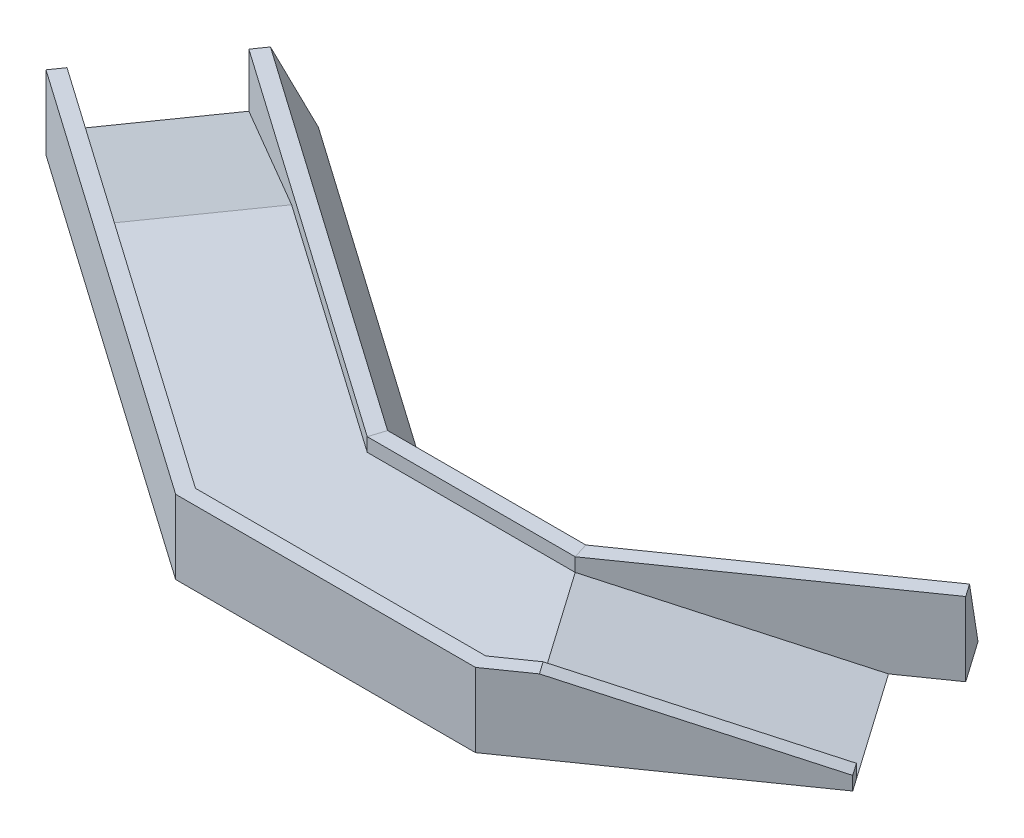
ISO-10303-21;
HEADER;
FILE_DESCRIPTION(('STEP AP214'),'2;1');
FILE_NAME('part.step','',(''),(''),'','','');
FILE_SCHEMA(('AUTOMOTIVE_DESIGN { 1 0 10303 214 1 1 1 1 }'));
ENDSEC;
DATA;
#1=APPLICATION_CONTEXT('core data for automotive mechanical design processes');
#2=APPLICATION_PROTOCOL_DEFINITION('international standard','automotive_design',2000,#1);
#3=PRODUCT_CONTEXT('',#1,'mechanical');
#4=PRODUCT('Part','Part','',(#3));
#5=PRODUCT_RELATED_PRODUCT_CATEGORY('part','',(#4));
#6=PRODUCT_DEFINITION_FORMATION('','',#4);
#7=PRODUCT_DEFINITION_CONTEXT('part definition',#1,'design');
#8=PRODUCT_DEFINITION('design','',#6,#7);
#9=PRODUCT_DEFINITION_SHAPE('','',#8);
#10=(LENGTH_UNIT() NAMED_UNIT(*) SI_UNIT(.MILLI.,.METRE.));
#11=(NAMED_UNIT(*) PLANE_ANGLE_UNIT() SI_UNIT($,.RADIAN.));
#12=(NAMED_UNIT(*) SI_UNIT($,.STERADIAN.) SOLID_ANGLE_UNIT());
#13=UNCERTAINTY_MEASURE_WITH_UNIT(LENGTH_MEASURE(1.E-05),#10,'distance_accuracy_value','');
#14=(GEOMETRIC_REPRESENTATION_CONTEXT(3) GLOBAL_UNCERTAINTY_ASSIGNED_CONTEXT((#13)) GLOBAL_UNIT_ASSIGNED_CONTEXT((#10,
#11,#12)) REPRESENTATION_CONTEXT('',''));
#15=CARTESIAN_POINT('',(0.,0.,0.));
#16=DIRECTION('',(0.,0.,1.));
#17=DIRECTION('',(1.,0.,0.));
#18=AXIS2_PLACEMENT_3D('',#15,#16,#17);
#19=CARTESIAN_POINT('',(0.,600.,0.));
#20=DIRECTION('',(0.,1.,0.));
#21=DIRECTION('',(0.,0.,1.));
#22=AXIS2_PLACEMENT_3D('',#19,#20,#21);
#23=PLANE('',#22);
#24=DIRECTION('',(0.819152044288991,0.,0.573576436351047));
#25=VECTOR('',#24,1.);
#26=CARTESIAN_POINT('',(0.,600.,0.));
#27=LINE('',#26,#25);
#28=CARTESIAN_POINT('',(-2510.30882601573,600.,-1757.73716321059));
#29=VERTEX_POINT('',#28);
#30=CARTESIAN_POINT('',(-4.19618988082814E-12,600.,0.));
#31=VERTEX_POINT('',#30);
#32=EDGE_CURVE('E333',#29,#31,#27,.T.);
#33=ORIENTED_EDGE('',*,*,#32,.F.);
#34=DIRECTION('',(-0.573576436351047,0.,0.819152044288991));
#35=VECTOR('',#34,1.);
#36=CARTESIAN_POINT('',(-2510.30882601573,600.,-1757.73716321059));
#37=LINE('',#36,#35);
#38=CARTESIAN_POINT('',(-3255.95819327209,600.,-692.839505634897));
#39=VERTEX_POINT('',#38);
#40=EDGE_CURVE('E206',#29,#39,#37,.T.);
#41=ORIENTED_EDGE('',*,*,#40,.T.);
#42=DIRECTION('',(-0.819152044288991,0.,-0.573576436351047));
#43=VECTOR('',#42,1.);
#44=CARTESIAN_POINT('',(-745.649367256361,600.,1064.89765757569));
#45=LINE('',#44,#43);
#46=CARTESIAN_POINT('',(-409.888425542679,600.,1300.));
#47=VERTEX_POINT('',#46);
#48=EDGE_CURVE('E195',#47,#39,#45,.T.);
#49=ORIENTED_EDGE('',*,*,#48,.F.);
#50=DIRECTION('',(-1.,0.,0.));
#51=VECTOR('',#50,1.);
#52=CARTESIAN_POINT('',(0.,600.,1300.));
#53=LINE('',#52,#51);
#54=CARTESIAN_POINT('',(2480.11157445732,600.,1300.));
#55=VERTEX_POINT('',#54);
#56=EDGE_CURVE('E46',#55,#47,#53,.T.);
#57=ORIENTED_EDGE('',*,*,#56,.F.);
#58=DIRECTION('',(-0.819152044288991,0.,0.573576436351048));
#59=VECTOR('',#58,1.);
#60=CARTESIAN_POINT('',(1426.73193265973,600.,2037.58436578332));
#61=LINE('',#60,#59);
#62=CARTESIAN_POINT('',(2815.6837142878,599.99999999999,1065.02985807754));
#63=VERTEX_POINT('',#62);
#64=EDGE_CURVE('E327',#63,#55,#61,.T.);
#65=ORIENTED_EDGE('',*,*,#64,.F.);
#66=DIRECTION('',(-0.573576436351046,0.,-0.819152044288992));
#67=VECTOR('',#66,1.);
#68=CARTESIAN_POINT('',(4145.36121802137,599.999999999982,2964.00613464447));
#69=LINE('',#68,#67);
#70=CARTESIAN_POINT('',(2070.03434703144,599.999999999994,0.132200501845925));
#71=VERTEX_POINT('',#70);
#72=EDGE_CURVE('E218',#63,#71,#69,.T.);
#73=ORIENTED_EDGE('',*,*,#72,.T.);
#74=DIRECTION('',(-0.819152044288992,0.,0.573576436351046));
#75=VECTOR('',#74,1.);
#76=CARTESIAN_POINT('',(3904.30457607769,600.,-1284.23764098999));
#77=LINE('',#76,#75);
#78=CARTESIAN_POINT('',(2070.22314891464,599.999999999994,1.54360257909578E-12));
#79=VERTEX_POINT('',#78);
#80=EDGE_CURVE('E213',#79,#71,#77,.T.);
#81=ORIENTED_EDGE('',*,*,#80,.F.);
#82=DIRECTION('',(1.,0.,0.));
#83=VECTOR('',#82,1.);
#84=CARTESIAN_POINT('',(0.,600.,0.));
#85=LINE('',#84,#83);
#86=EDGE_CURVE('E329',#31,#79,#85,.T.);
#87=ORIENTED_EDGE('',*,*,#86,.F.);
#88=EDGE_LOOP('',(#33,#41,#49,#57,#65,#73,#81,#87));
#89=FACE_BOUND('',#88,.T.);
#90=ADVANCED_FACE('F38',(#89),#23,.T.);
#91=CARTESIAN_POINT('',(-3929.5637528991,600.,-2751.51016165559));
#92=DIRECTION('',(-0.819152044288991,0.,-0.573576436351047));
#93=DIRECTION('',(-0.573576436351047,0.,0.819152044288991));
#94=AXIS2_PLACEMENT_3D('',#91,#92,#93);
#95=PLANE('',#94);
#96=DIRECTION('',(0.,-1.,0.));
#97=VECTOR('',#96,1.);
#98=CARTESIAN_POINT('',(-4675.21312015546,735.,-1686.6125040799));
#99=LINE('',#98,#97);
#100=CARTESIAN_POINT('',(-4675.21312015546,735.,-1686.6125040799));
#101=VERTEX_POINT('',#100);
#102=CARTESIAN_POINT('',(-4675.21312015546,200.,-1686.6125040799));
#103=VERTEX_POINT('',#102);
#104=EDGE_CURVE('E178',#101,#103,#99,.T.);
#105=ORIENTED_EDGE('',*,*,#104,.T.);
#106=DIRECTION('',(-0.573576436351047,0.,0.819152044288991));
#107=VECTOR('',#106,1.);
#108=CARTESIAN_POINT('',(-2565.42970008092,200.,-4699.69549011691));
#109=LINE('',#108,#107);
#110=CARTESIAN_POINT('',(-3929.5637528991,200.,-2751.51016165559));
#111=VERTEX_POINT('',#110);
#112=EDGE_CURVE('E182',#111,#103,#109,.T.);
#113=ORIENTED_EDGE('',*,*,#112,.F.);
#114=DIRECTION('',(0.,1.,0.));
#115=VECTOR('',#114,1.);
#116=CARTESIAN_POINT('',(-3929.5637528991,0.,-2751.5101616556));
#117=LINE('',#116,#115);
#118=CARTESIAN_POINT('',(-3929.5637528991,735.,-2751.51016165559));
#119=VERTEX_POINT('',#118);
#120=EDGE_CURVE('E232',#111,#119,#117,.T.);
#121=ORIENTED_EDGE('',*,*,#120,.T.);
#122=DIRECTION('',(0.573576436351047,0.,-0.819152044288991));
#123=VECTOR('',#122,1.);
#124=CARTESIAN_POINT('',(-3929.5637528991,735.,-2751.51016165559));
#125=LINE('',#124,#123);
#126=CARTESIAN_POINT('',(-3841.08163136633,735.,-2877.87572715494));
#127=VERTEX_POINT('',#126);
#128=EDGE_CURVE('E228',#119,#127,#125,.T.);
#129=ORIENTED_EDGE('',*,*,#128,.T.);
#130=DIRECTION('',(0.242403876506107,-0.906307787036648,-0.346188613058758));
#131=VECTOR('',#130,1.);
#132=CARTESIAN_POINT('',(-3841.08163136633,735.,-2877.87572715494));
#133=LINE('',#132,#131);
#134=CARTESIAN_POINT('',(-3644.49626403263,0.,-3158.62872766722));
#135=VERTEX_POINT('',#134);
#136=EDGE_CURVE('E225',#127,#135,#133,.T.);
#137=ORIENTED_EDGE('',*,*,#136,.T.);
#138=DIRECTION('',(0.573576436351047,0.,-0.819152044288991));
#139=VECTOR('',#138,1.);
#140=CARTESIAN_POINT('',(-3929.5637528991,0.,-2751.51016165559));
#141=LINE('',#140,#139);
#142=CARTESIAN_POINT('',(-4761.24958560812,0.,-1563.73969743656));
#143=VERTEX_POINT('',#142);
#144=EDGE_CURVE('E330',#143,#135,#141,.T.);
#145=ORIENTED_EDGE('',*,*,#144,.F.);
#146=DIRECTION('',(0.,-1.,0.));
#147=VECTOR('',#146,1.);
#148=CARTESIAN_POINT('',(-4761.24958560812,735.,-1563.73969743656));
#149=LINE('',#148,#147);
#150=CARTESIAN_POINT('',(-4761.24958560812,735.,-1563.73969743656));
#151=VERTEX_POINT('',#150);
#152=EDGE_CURVE('E188',#151,#143,#149,.T.);
#153=ORIENTED_EDGE('',*,*,#152,.F.);
#154=DIRECTION('',(-0.573576436351048,0.,0.81915204428899));
#155=VECTOR('',#154,1.);
#156=CARTESIAN_POINT('',(-4761.24958560812,735.,-1563.73969743656));
#157=LINE('',#156,#155);
#158=EDGE_CURVE('E184',#101,#151,#157,.T.);
#159=ORIENTED_EDGE('',*,*,#158,.F.);
#160=EDGE_LOOP('',(#105,#113,#121,#129,#137,#145,#153,#159));
#161=FACE_BOUND('',#160,.T.);
#162=ADVANCED_FACE('F180',(#161),#95,.T.);
#163=CARTESIAN_POINT('',(3223.22201067432,600.,-2256.92434919762));
#164=DIRECTION('',(0.819152044288991,0.,-0.573576436351048));
#165=DIRECTION('',(-0.573576436351048,0.,-0.819152044288991));
#166=AXIS2_PLACEMENT_3D('',#163,#164,#165);
#167=PLANE('',#166);
#168=DIRECTION('',(0.,-1.,0.));
#169=VECTOR('',#168,1.);
#170=CARTESIAN_POINT('',(4649.95394333405,735.,-219.339983414307));
#171=LINE('',#170,#169);
#172=CARTESIAN_POINT('',(4649.95394333405,135.000000000004,-219.339983414305));
#173=VERTEX_POINT('',#172);
#174=CARTESIAN_POINT('',(4649.95394333407,-1.26088293488827E-11,-219.339983414322));
#175=VERTEX_POINT('',#174);
#176=EDGE_CURVE('E312',#173,#175,#171,.T.);
#177=ORIENTED_EDGE('',*,*,#176,.F.);
#178=DIRECTION('',(-0.573576436351047,0.,-0.819152044288991));
#179=VECTOR('',#178,1.);
#180=CARTESIAN_POINT('',(5462.59230593635,135.000000000004,941.227874338341));
#181=LINE('',#180,#179);
#182=CARTESIAN_POINT('',(4735.99040878671,135.000000000004,-96.4671767709577));
#183=VERTEX_POINT('',#182);
#184=EDGE_CURVE('E209',#183,#173,#181,.T.);
#185=ORIENTED_EDGE('',*,*,#184,.F.);
#186=DIRECTION('',(0.,-1.,0.));
#187=VECTOR('',#186,1.);
#188=CARTESIAN_POINT('',(4735.99040878671,735.,-96.4671767709581));
#189=LINE('',#188,#187);
#190=CARTESIAN_POINT('',(4735.99040878671,0.,-96.4671767709579));
#191=VERTEX_POINT('',#190);
#192=EDGE_CURVE('E314',#183,#191,#189,.T.);
#193=ORIENTED_EDGE('',*,*,#192,.T.);
#194=DIRECTION('',(0.573576436351048,0.,0.819152044288991));
#195=VECTOR('',#194,1.);
#196=CARTESIAN_POINT('',(3223.22201067432,0.,-2256.92434919762));
#197=LINE('',#196,#195);
#198=EDGE_CURVE('E326',#175,#191,#197,.T.);
#199=ORIENTED_EDGE('',*,*,#198,.F.);
#200=EDGE_LOOP('',(#177,#185,#193,#199));
#201=FACE_BOUND('',#200,.T.);
#202=ADVANCED_FACE('F40',(#201),#167,.T.);
#203=CARTESIAN_POINT('',(2480.11157445732,735.,1300.));
#204=DIRECTION('',(0.573576436351048,0.,0.819152044288991));
#205=DIRECTION('',(0.819152044288991,0.,-0.573576436351048));
#206=AXIS2_PLACEMENT_3D('',#203,#204,#205);
#207=PLANE('',#206);
#208=DIRECTION('',(0.791240115236223,-0.258819045102519,-0.554032293222325));
#209=VECTOR('',#208,1.);
#210=CARTESIAN_POINT('',(1670.29324785109,1109.6635958974,1867.04089687006));
#211=LINE('',#210,#209);
#212=CARTESIAN_POINT('',(2815.6837142878,735.,1065.02985807754));
#213=VERTEX_POINT('',#212);
#214=EDGE_CURVE('E52',#213,#173,#211,.T.);
#215=ORIENTED_EDGE('',*,*,#214,.T.);
#216=ORIENTED_EDGE('',*,*,#176,.T.);
#217=DIRECTION('',(0.791240115236223,-0.258819045102519,-0.554032293222325));
#218=VECTOR('',#217,1.);
#219=CARTESIAN_POINT('',(4649.95394333405,-3.69724275688654E-12,-219.339983414303));
#220=LINE('',#219,#218);
#221=EDGE_CURVE('E217',#63,#175,#220,.T.);
#222=ORIENTED_EDGE('',*,*,#221,.F.);
#223=ORIENTED_EDGE('',*,*,#64,.T.);
#224=DIRECTION('',(0.,-1.,0.));
#225=VECTOR('',#224,1.);
#226=CARTESIAN_POINT('',(2480.11157445732,735.,1300.));
#227=LINE('',#226,#225);
#228=CARTESIAN_POINT('',(2480.11157445732,735.,1300.));
#229=VERTEX_POINT('',#228);
#230=EDGE_CURVE('E323',#229,#55,#227,.T.);
#231=ORIENTED_EDGE('',*,*,#230,.F.);
#232=DIRECTION('',(-0.819152044288991,0.,0.573576436351048));
#233=VECTOR('',#232,1.);
#234=CARTESIAN_POINT('',(2480.11157445732,735.,1300.));
#235=LINE('',#234,#233);
#236=EDGE_CURVE('E298',#213,#229,#235,.T.);
#237=ORIENTED_EDGE('',*,*,#236,.F.);
#238=EDGE_LOOP('',(#215,#216,#222,#223,#231,#237));
#239=FACE_BOUND('',#238,.T.);
#240=ADVANCED_FACE('F427',(#239),#207,.F.);
#241=CARTESIAN_POINT('',(4735.99040878671,735.,-96.4671767709581));
#242=DIRECTION('',(-0.573576436351048,0.,-0.819152044288991));
#243=DIRECTION('',(-0.819152044288991,0.,0.573576436351048));
#244=AXIS2_PLACEMENT_3D('',#241,#242,#243);
#245=PLANE('',#244);
#246=DIRECTION('',(0.791240115236223,-0.258819045102519,-0.554032293222325));
#247=VECTOR('',#246,1.);
#248=CARTESIAN_POINT('',(4613.11760214336,175.192378864672,-10.4307113183021));
#249=LINE('',#248,#247);
#250=CARTESIAN_POINT('',(2901.72017974045,735.,1187.90266472089));
#251=VERTEX_POINT('',#250);
#252=EDGE_CURVE('E211',#251,#183,#249,.T.);
#253=ORIENTED_EDGE('',*,*,#252,.F.);
#254=DIRECTION('',(0.819152044288991,0.,-0.573576436351048));
#255=VECTOR('',#254,1.);
#256=CARTESIAN_POINT('',(4735.99040878671,735.,-96.4671767709581));
#257=LINE('',#256,#255);
#258=CARTESIAN_POINT('',(2527.40639278917,735.,1450.));
#259=VERTEX_POINT('',#258);
#260=EDGE_CURVE('E309',#259,#251,#257,.T.);
#261=ORIENTED_EDGE('',*,*,#260,.F.);
#262=DIRECTION('',(0.,-1.,0.));
#263=VECTOR('',#262,1.);
#264=CARTESIAN_POINT('',(2527.40639278917,735.,1450.));
#265=LINE('',#264,#263);
#266=CARTESIAN_POINT('',(2527.40639278917,0.,1450.));
#267=VERTEX_POINT('',#266);
#268=EDGE_CURVE('E316',#259,#267,#265,.T.);
#269=ORIENTED_EDGE('',*,*,#268,.T.);
#270=DIRECTION('',(-0.819152044288991,0.,0.573576436351048));
#271=VECTOR('',#270,1.);
#272=CARTESIAN_POINT('',(4735.99040878671,0.,-96.4671767709581));
#273=LINE('',#272,#271);
#274=EDGE_CURVE('E295',#191,#267,#273,.T.);
#275=ORIENTED_EDGE('',*,*,#274,.F.);
#276=ORIENTED_EDGE('',*,*,#192,.F.);
#277=EDGE_LOOP('',(#253,#261,#269,#275,#276));
#278=FACE_BOUND('',#277,.T.);
#279=ADVANCED_FACE('F379',(#278),#245,.F.);
#280=CARTESIAN_POINT('',(0.,735.,0.));
#281=DIRECTION('',(0.,-1.,0.));
#282=DIRECTION('',(0.,0.,-1.));
#283=AXIS2_PLACEMENT_3D('',#280,#281,#282);
#284=PLANE('',#283);
#285=DIRECTION('',(0.573576436351047,0.,0.819152044288991));
#286=VECTOR('',#285,1.);
#287=CARTESIAN_POINT('',(1388.95178162806,735.,-972.554507705779));
#288=LINE('',#287,#286);
#289=EDGE_CURVE('E11',#213,#251,#288,.T.);
#290=ORIENTED_EDGE('',*,*,#289,.F.);
#291=ORIENTED_EDGE('',*,*,#236,.T.);
#292=DIRECTION('',(-1.,0.,0.));
#293=VECTOR('',#292,1.);
#294=CARTESIAN_POINT('',(-409.888425542679,735.,1300.));
#295=LINE('',#294,#293);
#296=CARTESIAN_POINT('',(-409.888425542679,735.,1300.));
#297=VERTEX_POINT('',#296);
#298=EDGE_CURVE('E300',#229,#297,#295,.T.);
#299=ORIENTED_EDGE('',*,*,#298,.T.);
#300=DIRECTION('',(-0.819152044288991,0.,-0.573576436351047));
#301=VECTOR('',#300,1.);
#302=CARTESIAN_POINT('',(-4675.21312015546,735.,-1686.6125040799));
#303=LINE('',#302,#301);
#304=EDGE_CURVE('E302',#297,#101,#303,.T.);
#305=ORIENTED_EDGE('',*,*,#304,.T.);
#306=ORIENTED_EDGE('',*,*,#158,.T.);
#307=DIRECTION('',(0.819152044288991,0.,0.573576436351047));
#308=VECTOR('',#307,1.);
#309=CARTESIAN_POINT('',(-457.183243874526,735.,1450.));
#310=LINE('',#309,#308);
#311=CARTESIAN_POINT('',(-457.183243874526,735.,1450.));
#312=VERTEX_POINT('',#311);
#313=EDGE_CURVE('E305',#151,#312,#310,.T.);
#314=ORIENTED_EDGE('',*,*,#313,.T.);
#315=DIRECTION('',(1.,0.,0.));
#316=VECTOR('',#315,1.);
#317=CARTESIAN_POINT('',(2527.40639278917,735.,1450.));
#318=LINE('',#317,#316);
#319=EDGE_CURVE('E307',#312,#259,#318,.T.);
#320=ORIENTED_EDGE('',*,*,#319,.T.);
#321=ORIENTED_EDGE('',*,*,#260,.T.);
#322=EDGE_LOOP('',(#290,#291,#299,#305,#306,#314,#320,#321));
#323=FACE_BOUND('',#322,.T.);
#324=ADVANCED_FACE('F391',(#323),#284,.F.);
#325=CARTESIAN_POINT('',(0.,0.,0.));
#326=DIRECTION('',(0.,1.,0.));
#327=DIRECTION('',(0.,0.,1.));
#328=AXIS2_PLACEMENT_3D('',#325,#326,#327);
#329=PLANE('',#328);
#330=DIRECTION('',(0.819152044288992,0.,-0.573576436351046));
#331=VECTOR('',#330,1.);
#332=CARTESIAN_POINT('',(1785.15566004816,0.,-407.118566011627));
#333=LINE('',#332,#331);
#334=CARTESIAN_POINT('',(1913.51965084178,0.,-497.000000000001));
#335=VERTEX_POINT('',#334);
#336=CARTESIAN_POINT('',(4071.40901565874,0.,-2007.9703998674));
#337=VERTEX_POINT('',#336);
#338=EDGE_CURVE('E265',#335,#337,#333,.T.);
#339=ORIENTED_EDGE('',*,*,#338,.T.);
#340=DIRECTION('',(0.573576436351046,0.,0.819152044288992));
#341=VECTOR('',#340,1.);
#342=CARTESIAN_POINT('',(4071.40901565874,0.,-2007.9703998674));
#343=LINE('',#342,#341);
#344=CARTESIAN_POINT('',(4356.47650452521,0.,-1600.85183385577));
#345=VERTEX_POINT('',#344);
#346=EDGE_CURVE('E283',#337,#345,#343,.T.);
#347=ORIENTED_EDGE('',*,*,#346,.T.);
#348=DIRECTION('',(0.819152044288992,0.,-0.573576436351046));
#349=VECTOR('',#348,1.);
#350=CARTESIAN_POINT('',(2070.22314891463,0.,2.22044604925031E-12));
#351=LINE('',#350,#349);
#352=CARTESIAN_POINT('',(3904.30457607769,0.,-1284.23764098999));
#353=VERTEX_POINT('',#352);
#354=EDGE_CURVE('E281',#353,#345,#351,.T.);
#355=ORIENTED_EDGE('',*,*,#354,.F.);
#356=EDGE_CURVE('E337',#353,#175,#197,.T.);
#357=ORIENTED_EDGE('',*,*,#356,.T.);
#358=ORIENTED_EDGE('',*,*,#198,.T.);
#359=ORIENTED_EDGE('',*,*,#274,.T.);
#360=DIRECTION('',(-1.,0.,0.));
#361=VECTOR('',#360,1.);
#362=CARTESIAN_POINT('',(2527.40639278917,0.,1450.));
#363=LINE('',#362,#361);
#364=CARTESIAN_POINT('',(-457.183243874526,0.,1450.));
#365=VERTEX_POINT('',#364);
#366=EDGE_CURVE('E292',#267,#365,#363,.T.);
#367=ORIENTED_EDGE('',*,*,#366,.T.);
#368=DIRECTION('',(-0.819152044288991,0.,-0.573576436351047));
#369=VECTOR('',#368,1.);
#370=CARTESIAN_POINT('',(-457.183243874526,0.,1450.));
#371=LINE('',#370,#369);
#372=EDGE_CURVE('E240',#365,#143,#371,.T.);
#373=ORIENTED_EDGE('',*,*,#372,.T.);
#374=ORIENTED_EDGE('',*,*,#144,.T.);
#375=DIRECTION('',(0.819152044288991,0.,0.573576436351047));
#376=VECTOR('',#375,1.);
#377=CARTESIAN_POINT('',(-3644.49626403263,0.,-3158.62872766722));
#378=LINE('',#377,#376);
#379=CARTESIAN_POINT('',(156.703498072856,0.,-497.));
#380=VERTEX_POINT('',#379);
#381=EDGE_CURVE('E229',#135,#380,#378,.T.);
#382=ORIENTED_EDGE('',*,*,#381,.T.);
#383=DIRECTION('',(1.,0.,0.));
#384=VECTOR('',#383,1.);
#385=CARTESIAN_POINT('',(-4.44089209850063E-12,0.,-497.));
#386=LINE('',#385,#384);
#387=EDGE_CURVE('E255',#380,#335,#386,.T.);
#388=ORIENTED_EDGE('',*,*,#387,.T.);
#389=EDGE_LOOP('',(#339,#347,#355,#357,#358,#359,#367,#373,#374,#382,#388));
#390=FACE_BOUND('',#389,.T.);
#391=ADVANCED_FACE('F339',(#390),#329,.F.);
#392=CARTESIAN_POINT('',(-409.888425542679,735.,1300.));
#393=DIRECTION('',(0.,0.,1.));
#394=DIRECTION('',(1.,0.,0.));
#395=AXIS2_PLACEMENT_3D('',#392,#393,#394);
#396=PLANE('',#395);
#397=ORIENTED_EDGE('',*,*,#56,.T.);
#398=DIRECTION('',(0.,-1.,0.));
#399=VECTOR('',#398,1.);
#400=CARTESIAN_POINT('',(-409.888425542679,735.,1300.));
#401=LINE('',#400,#399);
#402=EDGE_CURVE('E187',#297,#47,#401,.T.);
#403=ORIENTED_EDGE('',*,*,#402,.F.);
#404=ORIENTED_EDGE('',*,*,#298,.F.);
#405=ORIENTED_EDGE('',*,*,#230,.T.);
#406=EDGE_LOOP('',(#397,#403,#404,#405));
#407=FACE_BOUND('',#406,.T.);
#408=ADVANCED_FACE('F430',(#407),#396,.F.);
#409=CARTESIAN_POINT('',(-4675.21312015546,735.,-1686.6125040799));
#410=DIRECTION('',(-0.573576436351047,0.,0.819152044288991));
#411=DIRECTION('',(0.819152044288991,0.,0.573576436351047));
#412=AXIS2_PLACEMENT_3D('',#409,#410,#411);
#413=PLANE('',#412);
#414=ORIENTED_EDGE('',*,*,#104,.F.);
#415=ORIENTED_EDGE('',*,*,#304,.F.);
#416=ORIENTED_EDGE('',*,*,#402,.T.);
#417=ORIENTED_EDGE('',*,*,#48,.T.);
#418=DIRECTION('',(-0.798157230462824,-0.224951054343859,-0.558875709446655));
#419=VECTOR('',#418,1.);
#420=CARTESIAN_POINT('',(-4675.21312015546,200.,-1686.6125040799));
#421=LINE('',#420,#419);
#422=EDGE_CURVE('E191',#39,#103,#421,.T.);
#423=ORIENTED_EDGE('',*,*,#422,.T.);
#424=EDGE_LOOP('',(#414,#415,#416,#417,#423));
#425=FACE_BOUND('',#424,.T.);
#426=ADVANCED_FACE('F192',(#425),#413,.F.);
#427=CARTESIAN_POINT('',(-457.183243874526,735.,1450.));
#428=DIRECTION('',(0.573576436351047,0.,-0.819152044288991));
#429=DIRECTION('',(-0.819152044288991,0.,-0.573576436351047));
#430=AXIS2_PLACEMENT_3D('',#427,#428,#429);
#431=PLANE('',#430);
#432=ORIENTED_EDGE('',*,*,#152,.T.);
#433=ORIENTED_EDGE('',*,*,#372,.F.);
#434=DIRECTION('',(0.,-1.,0.));
#435=VECTOR('',#434,1.);
#436=CARTESIAN_POINT('',(-457.183243874526,735.,1450.));
#437=LINE('',#436,#435);
#438=EDGE_CURVE('E318',#312,#365,#437,.T.);
#439=ORIENTED_EDGE('',*,*,#438,.F.);
#440=ORIENTED_EDGE('',*,*,#313,.F.);
#441=EDGE_LOOP('',(#432,#433,#439,#440));
#442=FACE_BOUND('',#441,.T.);
#443=ADVANCED_FACE('F389',(#442),#431,.F.);
#444=CARTESIAN_POINT('',(2527.40639278917,735.,1450.));
#445=DIRECTION('',(0.,0.,-1.));
#446=DIRECTION('',(-1.,0.,0.));
#447=AXIS2_PLACEMENT_3D('',#444,#445,#446);
#448=PLANE('',#447);
#449=ORIENTED_EDGE('',*,*,#438,.T.);
#450=ORIENTED_EDGE('',*,*,#366,.F.);
#451=ORIENTED_EDGE('',*,*,#268,.F.);
#452=ORIENTED_EDGE('',*,*,#319,.F.);
#453=EDGE_LOOP('',(#449,#450,#451,#452));
#454=FACE_BOUND('',#453,.T.);
#455=ADVANCED_FACE('F384',(#454),#448,.F.);
#456=CARTESIAN_POINT('',(2070.22314891463,0.,2.22044604925031E-12));
#457=DIRECTION('',(-0.573576436351046,0.,-0.819152044288992));
#458=DIRECTION('',(-0.819152044288992,0.,0.573576436351046));
#459=AXIS2_PLACEMENT_3D('',#456,#457,#458);
#460=PLANE('',#459);
#461=DIRECTION('',(0.791240115236224,-0.258819045102519,-0.554032293222324));
#462=VECTOR('',#461,1.);
#463=CARTESIAN_POINT('',(3904.30457607769,0.,-1284.23764098999));
#464=LINE('',#463,#462);
#465=EDGE_CURVE('E214',#71,#353,#464,.T.);
#466=ORIENTED_EDGE('',*,*,#465,.T.);
#467=ORIENTED_EDGE('',*,*,#354,.T.);
#468=DIRECTION('',(0.,1.,0.));
#469=VECTOR('',#468,1.);
#470=CARTESIAN_POINT('',(4356.47650452521,0.,-1600.85183385577));
#471=LINE('',#470,#469);
#472=CARTESIAN_POINT('',(4356.47650452521,735.,-1600.85183385576));
#473=VERTEX_POINT('',#472);
#474=EDGE_CURVE('E279',#345,#473,#471,.T.);
#475=ORIENTED_EDGE('',*,*,#474,.T.);
#476=DIRECTION('',(0.819152044288992,0.,-0.573576436351046));
#477=VECTOR('',#476,1.);
#478=CARTESIAN_POINT('',(2070.22314891463,735.,3.99680288865056E-12));
#479=LINE('',#478,#477);
#480=CARTESIAN_POINT('',(2070.22314891463,735.,3.37588030446812E-12));
#481=VERTEX_POINT('',#480);
#482=EDGE_CURVE('E276',#481,#473,#479,.T.);
#483=ORIENTED_EDGE('',*,*,#482,.F.);
#484=DIRECTION('',(0.,1.,0.));
#485=VECTOR('',#484,1.);
#486=CARTESIAN_POINT('',(2070.22314891463,0.,-3.53666748664772E-13));
#487=LINE('',#486,#485);
#488=EDGE_CURVE('E252',#79,#481,#487,.T.);
#489=ORIENTED_EDGE('',*,*,#488,.F.);
#490=ORIENTED_EDGE('',*,*,#80,.T.);
#491=EDGE_LOOP('',(#466,#467,#475,#483,#489,#490));
#492=FACE_BOUND('',#491,.T.);
#493=ADVANCED_FACE('F362',(#492),#460,.F.);
#494=CARTESIAN_POINT('',(4356.47650452521,1.18959085942724E-12,-1600.85183385577));
#495=DIRECTION('',(-0.819152044288992,0.,0.573576436351046));
#496=DIRECTION('',(0.573576436351046,0.,0.819152044288992));
#497=AXIS2_PLACEMENT_3D('',#494,#495,#496);
#498=PLANE('',#497);
#499=ORIENTED_EDGE('',*,*,#346,.F.);
#500=DIRECTION('',(-0.242403876506107,-0.906307787036648,-0.346188613058758));
#501=VECTOR('',#500,1.);
#502=CARTESIAN_POINT('',(4267.99438299244,735.,-1727.21739935511));
#503=LINE('',#502,#501);
#504=CARTESIAN_POINT('',(4267.99438299244,735.,-1727.21739935511));
#505=VERTEX_POINT('',#504);
#506=EDGE_CURVE('E222',#505,#337,#503,.T.);
#507=ORIENTED_EDGE('',*,*,#506,.F.);
#508=DIRECTION('',(-0.573576436351046,0.,-0.819152044288992));
#509=VECTOR('',#508,1.);
#510=CARTESIAN_POINT('',(4356.47650452521,735.,-1600.85183385576));
#511=LINE('',#510,#509);
#512=EDGE_CURVE('E274',#473,#505,#511,.T.);
#513=ORIENTED_EDGE('',*,*,#512,.F.);
#514=ORIENTED_EDGE('',*,*,#474,.F.);
#515=EDGE_LOOP('',(#499,#507,#513,#514));
#516=FACE_BOUND('',#515,.T.);
#517=ADVANCED_FACE('F359',(#516),#498,.F.);
#518=CARTESIAN_POINT('',(2070.22314891463,735.,3.99680288865056E-12));
#519=DIRECTION('',(0.,-1.,0.));
#520=DIRECTION('',(0.,0.,-1.));
#521=AXIS2_PLACEMENT_3D('',#518,#519,#520);
#522=PLANE('',#521);
#523=DIRECTION('',(0.300705799504273,0.,0.953716950748227));
#524=VECTOR('',#523,1.);
#525=CARTESIAN_POINT('',(1883.02533674123,735.,-593.715608102947));
#526=LINE('',#525,#524);
#527=CARTESIAN_POINT('',(2021.58393713981,735.,-154.263871256072));
#528=VERTEX_POINT('',#527);
#529=EDGE_CURVE('E262',#528,#481,#526,.T.);
#530=ORIENTED_EDGE('',*,*,#529,.T.);
#531=ORIENTED_EDGE('',*,*,#482,.T.);
#532=ORIENTED_EDGE('',*,*,#512,.T.);
#533=DIRECTION('',(0.819152044288992,0.,-0.573576436351046));
#534=VECTOR('',#533,1.);
#535=CARTESIAN_POINT('',(1981.74102738186,735.,-126.365565499344));
#536=LINE('',#535,#534);
#537=EDGE_CURVE('E273',#528,#505,#536,.T.);
#538=ORIENTED_EDGE('',*,*,#537,.F.);
#539=EDGE_LOOP('',(#530,#531,#532,#538));
#540=FACE_BOUND('',#539,.T.);
#541=ADVANCED_FACE('F409',(#540),#522,.F.);
#542=CARTESIAN_POINT('',(1981.74102738186,735.,-126.365565499344));
#543=DIRECTION('',(0.519836790725683,-0.422618261740704,0.742403876506103));
#544=DIRECTION('',(0.819152044288992,0.,-0.573576436351046));
#545=AXIS2_PLACEMENT_3D('',#542,#543,#544);
#546=PLANE('',#545);
#547=DIRECTION('',(0.132083558623478,0.898367248921761,0.41891552800786));
#548=VECTOR('',#547,1.);
#549=CARTESIAN_POINT('',(1986.31524942075,495.119773502042,-266.121857912027));
#550=LINE('',#549,#548);
#551=EDGE_CURVE('E258',#335,#528,#550,.T.);
#552=ORIENTED_EDGE('',*,*,#551,.T.);
#553=ORIENTED_EDGE('',*,*,#537,.T.);
#554=ORIENTED_EDGE('',*,*,#506,.T.);
#555=ORIENTED_EDGE('',*,*,#338,.F.);
#556=EDGE_LOOP('',(#552,#553,#554,#555));
#557=FACE_BOUND('',#556,.T.);
#558=ADVANCED_FACE('F354',(#557),#546,.F.);
#559=CARTESIAN_POINT('',(-3.5527136788005E-12,0.,0.));
#560=DIRECTION('',(0.,0.,-1.));
#561=DIRECTION('',(0.,1.,0.));
#562=AXIS2_PLACEMENT_3D('',#559,#560,#561);
#563=PLANE('',#562);
#564=ORIENTED_EDGE('',*,*,#86,.T.);
#565=ORIENTED_EDGE('',*,*,#488,.T.);
#566=DIRECTION('',(1.,0.,0.));
#567=VECTOR('',#566,1.);
#568=CARTESIAN_POINT('',(-3.5527136788005E-12,735.,3.10862446895044E-12));
#569=LINE('',#568,#567);
#570=CARTESIAN_POINT('',(-3.99680288865056E-12,735.,1.55431223447522E-12));
#571=VERTEX_POINT('',#570);
#572=EDGE_CURVE('E254',#571,#481,#569,.T.);
#573=ORIENTED_EDGE('',*,*,#572,.F.);
#574=DIRECTION('',(0.,1.,0.));
#575=VECTOR('',#574,1.);
#576=CARTESIAN_POINT('',(-3.10862446895044E-12,0.,-1.77635683940025E-12));
#577=LINE('',#576,#575);
#578=EDGE_CURVE('E235',#31,#571,#577,.T.);
#579=ORIENTED_EDGE('',*,*,#578,.F.);
#580=EDGE_LOOP('',(#564,#565,#573,#579));
#581=FACE_BOUND('',#580,.T.);
#582=ADVANCED_FACE('F416',(#581),#563,.F.);
#583=CARTESIAN_POINT('',(-3.5527136788005E-12,735.,3.10862446895044E-12));
#584=DIRECTION('',(0.,-1.,0.));
#585=DIRECTION('',(0.,0.,-1.));
#586=AXIS2_PLACEMENT_3D('',#583,#584,#585);
#587=PLANE('',#586);
#588=DIRECTION('',(1.,0.,0.));
#589=VECTOR('',#588,1.);
#590=CARTESIAN_POINT('',(-3.5527136788005E-12,735.,-154.263871256072));
#591=LINE('',#590,#589);
#592=CARTESIAN_POINT('',(48.639211774822,735.,-154.263871256072));
#593=VERTEX_POINT('',#592);
#594=EDGE_CURVE('E247',#593,#528,#591,.T.);
#595=ORIENTED_EDGE('',*,*,#594,.F.);
#596=DIRECTION('',(-0.300705799504274,0.,0.953716950748227));
#597=VECTOR('',#596,1.);
#598=CARTESIAN_POINT('',(433.773910779113,735.,-1375.75508082779));
#599=LINE('',#598,#597);
#600=EDGE_CURVE('E244',#593,#571,#599,.T.);
#601=ORIENTED_EDGE('',*,*,#600,.T.);
#602=ORIENTED_EDGE('',*,*,#572,.T.);
#603=ORIENTED_EDGE('',*,*,#529,.F.);
#604=EDGE_LOOP('',(#595,#601,#602,#603));
#605=FACE_BOUND('',#604,.T.);
#606=ADVANCED_FACE('F406',(#605),#587,.F.);
#607=CARTESIAN_POINT('',(-3.5527136788005E-12,735.,-154.263871256072));
#608=DIRECTION('',(0.,-0.422618261740704,0.906307787036648));
#609=DIRECTION('',(0.,-0.906307787036648,-0.422618261740704));
#610=AXIS2_PLACEMENT_3D('',#607,#608,#609);
#611=PLANE('',#610);
#612=ORIENTED_EDGE('',*,*,#387,.F.);
#613=DIRECTION('',(-0.132083558623479,0.898367248921761,0.41891552800786));
#614=VECTOR('',#613,1.);
#615=CARTESIAN_POINT('',(131.481376191207,171.548438601492,-417.005649335592));
#616=LINE('',#615,#614);
#617=EDGE_CURVE('E241',#380,#593,#616,.T.);
#618=ORIENTED_EDGE('',*,*,#617,.T.);
#619=ORIENTED_EDGE('',*,*,#594,.T.);
#620=ORIENTED_EDGE('',*,*,#551,.F.);
#621=EDGE_LOOP('',(#612,#618,#619,#620));
#622=FACE_BOUND('',#621,.T.);
#623=ADVANCED_FACE('F348',(#622),#611,.F.);
#624=CARTESIAN_POINT('',(-3929.5637528991,0.,-2751.5101616556));
#625=DIRECTION('',(0.573576436351047,0.,-0.819152044288991));
#626=DIRECTION('',(-0.819152044288991,0.,-0.573576436351047));
#627=AXIS2_PLACEMENT_3D('',#624,#625,#626);
#628=PLANE('',#627);
#629=ORIENTED_EDGE('',*,*,#120,.F.);
#630=DIRECTION('',(-0.798157230462823,-0.224951054343859,-0.558875709446656));
#631=VECTOR('',#630,1.);
#632=CARTESIAN_POINT('',(-3929.5637528991,200.,-2751.51016165559));
#633=LINE('',#632,#631);
#634=EDGE_CURVE('E198',#29,#111,#633,.T.);
#635=ORIENTED_EDGE('',*,*,#634,.F.);
#636=ORIENTED_EDGE('',*,*,#32,.T.);
#637=ORIENTED_EDGE('',*,*,#578,.T.);
#638=DIRECTION('',(0.819152044288991,0.,0.573576436351047));
#639=VECTOR('',#638,1.);
#640=CARTESIAN_POINT('',(-3929.5637528991,735.,-2751.51016165559));
#641=LINE('',#640,#639);
#642=EDGE_CURVE('E233',#119,#571,#641,.T.);
#643=ORIENTED_EDGE('',*,*,#642,.F.);
#644=EDGE_LOOP('',(#629,#635,#636,#637,#643));
#645=FACE_BOUND('',#644,.T.);
#646=ADVANCED_FACE('F400',(#645),#628,.F.);
#647=CARTESIAN_POINT('',(-3929.5637528991,735.,-2751.51016165559));
#648=DIRECTION('',(0.,-1.,0.));
#649=DIRECTION('',(0.,0.,-1.));
#650=AXIS2_PLACEMENT_3D('',#647,#648,#649);
#651=PLANE('',#650);
#652=DIRECTION('',(0.819152044288991,0.,0.573576436351047));
#653=VECTOR('',#652,1.);
#654=CARTESIAN_POINT('',(-3841.08163136633,735.,-2877.87572715494));
#655=LINE('',#654,#653);
#656=EDGE_CURVE('E236',#127,#593,#655,.T.);
#657=ORIENTED_EDGE('',*,*,#656,.F.);
#658=ORIENTED_EDGE('',*,*,#128,.F.);
#659=ORIENTED_EDGE('',*,*,#642,.T.);
#660=ORIENTED_EDGE('',*,*,#600,.F.);
#661=EDGE_LOOP('',(#657,#658,#659,#660));
#662=FACE_BOUND('',#661,.T.);
#663=ADVANCED_FACE('F403',(#662),#651,.F.);
#664=CARTESIAN_POINT('',(-3841.08163136633,735.,-2877.87572715494));
#665=DIRECTION('',(-0.519836790725684,-0.422618261740704,0.742403876506102));
#666=DIRECTION('',(0.819152044288991,0.,0.573576436351047));
#667=AXIS2_PLACEMENT_3D('',#664,#665,#666);
#668=PLANE('',#667);
#669=ORIENTED_EDGE('',*,*,#381,.F.);
#670=ORIENTED_EDGE('',*,*,#136,.F.);
#671=ORIENTED_EDGE('',*,*,#656,.T.);
#672=ORIENTED_EDGE('',*,*,#617,.F.);
#673=EDGE_LOOP('',(#669,#670,#671,#672));
#674=FACE_BOUND('',#673,.T.);
#675=ADVANCED_FACE('F345',(#674),#668,.F.);
#676=CARTESIAN_POINT('',(5979.63144706762,-1.26088293549483E-11,1679.63629315263));
#677=DIRECTION('',(0.212012149896655,0.965925826289069,-0.148452505549681));
#678=DIRECTION('',(-0.976748652139603,0.214387664158805,0.));
#679=AXIS2_PLACEMENT_3D('',#676,#677,#678);
#680=PLANE('',#679);
#681=ORIENTED_EDGE('',*,*,#221,.T.);
#682=ORIENTED_EDGE('',*,*,#356,.F.);
#683=ORIENTED_EDGE('',*,*,#465,.F.);
#684=ORIENTED_EDGE('',*,*,#72,.F.);
#685=EDGE_LOOP('',(#681,#682,#683,#684));
#686=FACE_BOUND('',#685,.T.);
#687=ADVANCED_FACE('F369',(#686),#680,.T.);
#688=CARTESIAN_POINT('',(2482.93161045339,1109.6635958974,3027.60875462271));
#689=DIRECTION('',(0.212012149896653,0.965925826289069,-0.148452505549684));
#690=DIRECTION('',(-0.976748652139604,0.214387664158803,0.));
#691=AXIS2_PLACEMENT_3D('',#688,#689,#690);
#692=PLANE('',#691);
#693=ORIENTED_EDGE('',*,*,#252,.T.);
#694=ORIENTED_EDGE('',*,*,#184,.T.);
#695=ORIENTED_EDGE('',*,*,#214,.F.);
#696=ORIENTED_EDGE('',*,*,#289,.T.);
#697=EDGE_LOOP('',(#693,#694,#695,#696));
#698=FACE_BOUND('',#697,.T.);
#699=ADVANCED_FACE('F532',(#698),#692,.T.);
#700=CARTESIAN_POINT('',(-2565.42970008092,200.,-4699.69549011691));
#701=DIRECTION('',(-0.184269116030736,0.974370064785237,-0.129026624103961));
#702=DIRECTION('',(-0.982583351500274,-0.185822381199058,0.));
#703=AXIS2_PLACEMENT_3D('',#700,#701,#702);
#704=PLANE('',#703);
#705=ORIENTED_EDGE('',*,*,#634,.T.);
#706=ORIENTED_EDGE('',*,*,#112,.T.);
#707=ORIENTED_EDGE('',*,*,#422,.F.);
#708=ORIENTED_EDGE('',*,*,#40,.F.);
#709=EDGE_LOOP('',(#705,#706,#707,#708));
#710=FACE_BOUND('',#709,.T.);
#711=ADVANCED_FACE('F201',(#710),#704,.T.);
#712=CLOSED_SHELL('',(#90,#162,#202,#240,#279,#324,#391,#408,#426,#443,#455,#493,#517,#541,#558,
#582,#606,#623,#646,#663,#675,#687,#699,#711));
#713=MANIFOLD_SOLID_BREP('B2',#712);
#714=ADVANCED_BREP_SHAPE_REPRESENTATION('',(#18,#713),#14);
#715=SHAPE_DEFINITION_REPRESENTATION(#9,#714);
ENDSEC;
END-ISO-10303-21;
